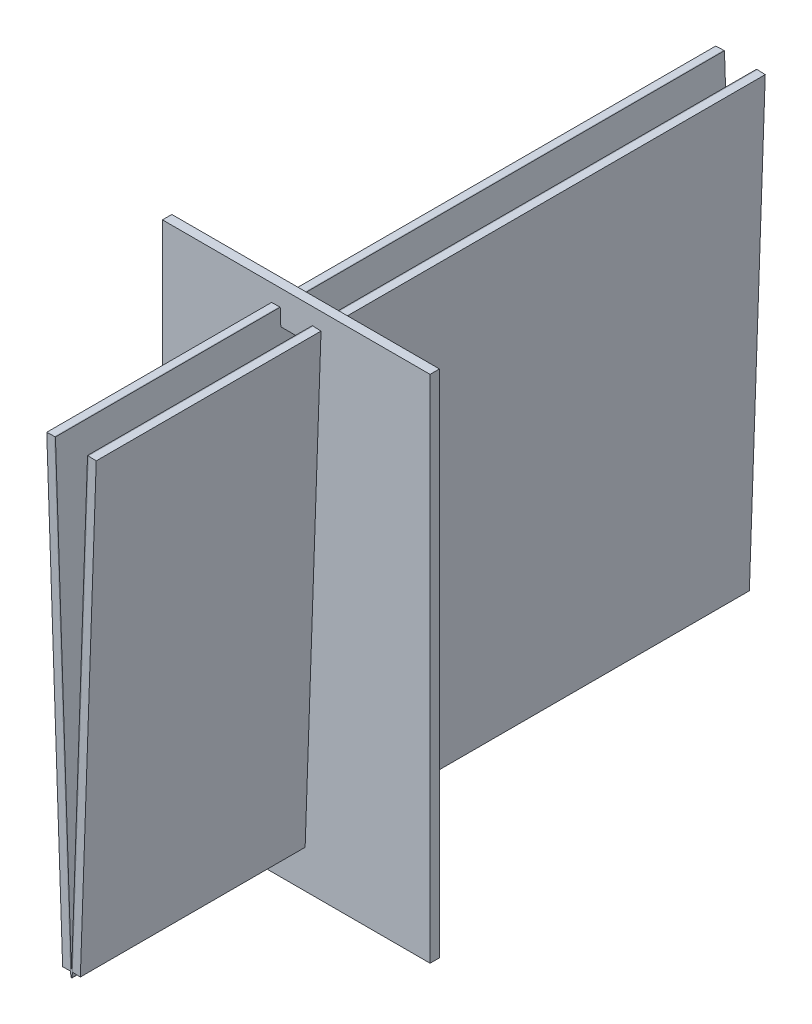
ISO-10303-21;
HEADER;
FILE_DESCRIPTION(('STEP AP214'),'2;1');
FILE_NAME('part.step','',(''),(''),'','','');
FILE_SCHEMA(('AUTOMOTIVE_DESIGN { 1 0 10303 214 1 1 1 1 }'));
ENDSEC;
DATA;
#1=APPLICATION_CONTEXT('core data for automotive mechanical design processes');
#2=APPLICATION_PROTOCOL_DEFINITION('international standard','automotive_design',2000,#1);
#3=PRODUCT_CONTEXT('',#1,'mechanical');
#4=PRODUCT('Part','Part','',(#3));
#5=PRODUCT_RELATED_PRODUCT_CATEGORY('part','',(#4));
#6=PRODUCT_DEFINITION_FORMATION('','',#4);
#7=PRODUCT_DEFINITION_CONTEXT('part definition',#1,'design');
#8=PRODUCT_DEFINITION('design','',#6,#7);
#9=PRODUCT_DEFINITION_SHAPE('','',#8);
#10=(LENGTH_UNIT() NAMED_UNIT(*) SI_UNIT(.MILLI.,.METRE.));
#11=(NAMED_UNIT(*) PLANE_ANGLE_UNIT() SI_UNIT($,.RADIAN.));
#12=(NAMED_UNIT(*) SI_UNIT($,.STERADIAN.) SOLID_ANGLE_UNIT());
#13=UNCERTAINTY_MEASURE_WITH_UNIT(LENGTH_MEASURE(1.E-05),#10,'distance_accuracy_value','');
#14=(GEOMETRIC_REPRESENTATION_CONTEXT(3) GLOBAL_UNCERTAINTY_ASSIGNED_CONTEXT((#13)) GLOBAL_UNIT_ASSIGNED_CONTEXT((#10,
#11,#12)) REPRESENTATION_CONTEXT('',''));
#15=CARTESIAN_POINT('',(0.,0.,0.));
#16=DIRECTION('',(0.,0.,1.));
#17=DIRECTION('',(1.,0.,0.));
#18=AXIS2_PLACEMENT_3D('',#15,#16,#17);
#19=CARTESIAN_POINT('',(0.,0.,32.8));
#20=DIRECTION('',(0.,0.,-1.));
#21=DIRECTION('',(-1.,0.,0.));
#22=AXIS2_PLACEMENT_3D('',#19,#20,#21);
#23=PLANE('',#22);
#24=DIRECTION('',(0.,1.,0.));
#25=VECTOR('',#24,1.);
#26=CARTESIAN_POINT('',(40.,141.029182993189,32.8));
#27=LINE('',#26,#25);
#28=CARTESIAN_POINT('',(40.,-11.4351401860784,32.8));
#29=VERTEX_POINT('',#28);
#30=CARTESIAN_POINT('',(40.,141.029182993189,32.8));
#31=VERTEX_POINT('',#30);
#32=EDGE_CURVE('E203',#29,#31,#27,.T.);
#33=ORIENTED_EDGE('',*,*,#32,.T.);
#34=DIRECTION('',(-1.,0.,0.));
#35=VECTOR('',#34,1.);
#36=CARTESIAN_POINT('',(-40.,141.029182993189,32.8));
#37=LINE('',#36,#35);
#38=CARTESIAN_POINT('',(-40.,141.029182993189,32.8));
#39=VERTEX_POINT('',#38);
#40=EDGE_CURVE('E206',#31,#39,#37,.T.);
#41=ORIENTED_EDGE('',*,*,#40,.T.);
#42=DIRECTION('',(0.,-1.,0.));
#43=VECTOR('',#42,1.);
#44=CARTESIAN_POINT('',(-40.,-11.4351401860784,32.8));
#45=LINE('',#44,#43);
#46=CARTESIAN_POINT('',(-40.,-11.4351401860784,32.8));
#47=VERTEX_POINT('',#46);
#48=EDGE_CURVE('E209',#39,#47,#45,.T.);
#49=ORIENTED_EDGE('',*,*,#48,.T.);
#50=DIRECTION('',(1.,0.,0.));
#51=VECTOR('',#50,1.);
#52=CARTESIAN_POINT('',(40.,-11.4351401860784,32.8));
#53=LINE('',#52,#51);
#54=EDGE_CURVE('E211',#47,#29,#53,.T.);
#55=ORIENTED_EDGE('',*,*,#54,.T.);
#56=EDGE_LOOP('',(#33,#41,#49,#55));
#57=FACE_BOUND('',#56,.T.);
#58=DIRECTION('',(-0.999390827019096,-0.0348994967025024,0.));
#59=VECTOR('',#58,1.);
#60=CARTESIAN_POINT('',(-4.80012183459618,136.029182993189,32.8));
#61=LINE('',#60,#59);
#62=CARTESIAN_POINT('',(-4.80012183459618,136.029182993189,32.8));
#63=VERTEX_POINT('',#62);
#64=CARTESIAN_POINT('',(-7.39853798484583,135.938444301763,32.8));
#65=VERTEX_POINT('',#64);
#66=EDGE_CURVE('E138',#63,#65,#61,.T.);
#67=ORIENTED_EDGE('',*,*,#66,.F.);
#68=DIRECTION('',(-0.0348994967025014,0.999390827019096,0.));
#69=VECTOR('',#68,1.);
#70=CARTESIAN_POINT('',(-4.80012183459618,136.029182993189,32.8));
#71=LINE('',#70,#69);
#72=CARTESIAN_POINT('',(-4.62551798713744,131.029182993189,32.8));
#73=VERTEX_POINT('',#72);
#74=EDGE_CURVE('E171',#73,#63,#71,.T.);
#75=ORIENTED_EDGE('',*,*,#74,.F.);
#76=DIRECTION('',(-1.,0.,0.));
#77=VECTOR('',#76,1.);
#78=CARTESIAN_POINT('',(-4.62551798713744,131.029182993189,32.8));
#79=LINE('',#78,#77);
#80=CARTESIAN_POINT('',(4.62551798713744,131.029182993189,32.8));
#81=VERTEX_POINT('',#80);
#82=EDGE_CURVE('E169',#81,#73,#79,.T.);
#83=ORIENTED_EDGE('',*,*,#82,.F.);
#84=DIRECTION('',(-0.0348994967025012,-0.999390827019096,0.));
#85=VECTOR('',#84,1.);
#86=CARTESIAN_POINT('',(4.62551798713744,131.029182993189,32.8));
#87=LINE('',#86,#85);
#88=CARTESIAN_POINT('',(4.80012183459618,136.029182993189,32.8));
#89=VERTEX_POINT('',#88);
#90=EDGE_CURVE('E167',#89,#81,#87,.T.);
#91=ORIENTED_EDGE('',*,*,#90,.F.);
#92=DIRECTION('',(-0.999390827019096,0.0348994967025024,0.));
#93=VECTOR('',#92,1.);
#94=CARTESIAN_POINT('',(4.80012183459618,136.029182993189,32.8));
#95=LINE('',#94,#93);
#96=CARTESIAN_POINT('',(7.39853798484583,135.938444301763,32.8));
#97=VERTEX_POINT('',#96);
#98=EDGE_CURVE('E165',#97,#89,#95,.T.);
#99=ORIENTED_EDGE('',*,*,#98,.F.);
#100=DIRECTION('',(0.034899496702501,0.999390827019096,0.));
#101=VECTOR('',#100,1.);
#102=CARTESIAN_POINT('',(2.90079230508252,7.13985981392158,32.8));
#103=LINE('',#102,#101);
#104=CARTESIAN_POINT('',(2.90079230508252,7.13985981392158,32.8));
#105=VERTEX_POINT('',#104);
#106=EDGE_CURVE('E161',#105,#97,#103,.T.);
#107=ORIENTED_EDGE('',*,*,#106,.F.);
#108=DIRECTION('',(1.,0.,0.));
#109=VECTOR('',#108,1.);
#110=CARTESIAN_POINT('',(-2.90079230508252,7.13985981392158,32.8));
#111=LINE('',#110,#109);
#112=CARTESIAN_POINT('',(-2.90079230508252,7.13985981392158,32.8));
#113=VERTEX_POINT('',#112);
#114=EDGE_CURVE('E159',#113,#105,#111,.T.);
#115=ORIENTED_EDGE('',*,*,#114,.F.);
#116=DIRECTION('',(0.0348994967025011,-0.999390827019096,0.));
#117=VECTOR('',#116,1.);
#118=CARTESIAN_POINT('',(-7.39853798484583,135.938444301763,32.8));
#119=LINE('',#118,#117);
#120=EDGE_CURVE('E146',#65,#113,#119,.T.);
#121=ORIENTED_EDGE('',*,*,#120,.F.);
#122=EDGE_LOOP('',(#67,#75,#83,#91,#99,#107,#115,#121));
#123=FACE_BOUND('',#122,.T.);
#124=ADVANCED_FACE('F49',(#57,#123),#23,.F.);
#125=CARTESIAN_POINT('',(0.,0.,30.));
#126=DIRECTION('',(0.,0.,-1.));
#127=DIRECTION('',(-1.,0.,0.));
#128=AXIS2_PLACEMENT_3D('',#125,#126,#127);
#129=PLANE('',#128);
#130=DIRECTION('',(0.,1.,0.));
#131=VECTOR('',#130,1.);
#132=CARTESIAN_POINT('',(40.,141.029182993189,30.));
#133=LINE('',#132,#131);
#134=CARTESIAN_POINT('',(40.,-11.4351401860784,30.));
#135=VERTEX_POINT('',#134);
#136=CARTESIAN_POINT('',(40.,141.029182993189,30.));
#137=VERTEX_POINT('',#136);
#138=EDGE_CURVE('E154',#135,#137,#133,.T.);
#139=ORIENTED_EDGE('',*,*,#138,.F.);
#140=DIRECTION('',(1.,0.,0.));
#141=VECTOR('',#140,1.);
#142=CARTESIAN_POINT('',(40.,-11.4351401860784,30.));
#143=LINE('',#142,#141);
#144=CARTESIAN_POINT('',(-40.,-11.4351401860784,30.));
#145=VERTEX_POINT('',#144);
#146=EDGE_CURVE('E207',#145,#135,#143,.T.);
#147=ORIENTED_EDGE('',*,*,#146,.F.);
#148=DIRECTION('',(0.,-1.,0.));
#149=VECTOR('',#148,1.);
#150=CARTESIAN_POINT('',(-40.,-11.4351401860784,30.));
#151=LINE('',#150,#149);
#152=CARTESIAN_POINT('',(-40.,141.029182993189,30.));
#153=VERTEX_POINT('',#152);
#154=EDGE_CURVE('E218',#153,#145,#151,.T.);
#155=ORIENTED_EDGE('',*,*,#154,.F.);
#156=DIRECTION('',(-1.,0.,0.));
#157=VECTOR('',#156,1.);
#158=CARTESIAN_POINT('',(-40.,141.029182993189,30.));
#159=LINE('',#158,#157);
#160=EDGE_CURVE('E216',#137,#153,#159,.T.);
#161=ORIENTED_EDGE('',*,*,#160,.F.);
#162=EDGE_LOOP('',(#139,#147,#155,#161));
#163=FACE_BOUND('',#162,.T.);
#164=DIRECTION('',(-0.0348994967025014,0.999390827019096,0.));
#165=VECTOR('',#164,1.);
#166=CARTESIAN_POINT('',(-4.80012183459618,136.029182993189,30.));
#167=LINE('',#166,#165);
#168=CARTESIAN_POINT('',(-4.62551798713744,131.029182993189,30.));
#169=VERTEX_POINT('',#168);
#170=CARTESIAN_POINT('',(-4.80012183459618,136.029182993189,30.));
#171=VERTEX_POINT('',#170);
#172=EDGE_CURVE('E147',#169,#171,#167,.T.);
#173=ORIENTED_EDGE('',*,*,#172,.T.);
#174=DIRECTION('',(-0.999390827019096,-0.0348994967025024,0.));
#175=VECTOR('',#174,1.);
#176=CARTESIAN_POINT('',(-4.80012183459618,136.029182993189,30.));
#177=LINE('',#176,#175);
#178=CARTESIAN_POINT('',(-7.39853798484583,135.938444301763,30.));
#179=VERTEX_POINT('',#178);
#180=EDGE_CURVE('E72',#171,#179,#177,.T.);
#181=ORIENTED_EDGE('',*,*,#180,.T.);
#182=DIRECTION('',(0.0348994967025011,-0.999390827019096,0.));
#183=VECTOR('',#182,1.);
#184=CARTESIAN_POINT('',(-7.39853798484583,135.938444301763,30.));
#185=LINE('',#184,#183);
#186=CARTESIAN_POINT('',(-2.90079230508252,7.13985981392158,30.));
#187=VERTEX_POINT('',#186);
#188=EDGE_CURVE('E153',#179,#187,#185,.T.);
#189=ORIENTED_EDGE('',*,*,#188,.T.);
#190=DIRECTION('',(1.,0.,0.));
#191=VECTOR('',#190,1.);
#192=CARTESIAN_POINT('',(-2.90079230508252,7.13985981392158,30.));
#193=LINE('',#192,#191);
#194=CARTESIAN_POINT('',(2.90079230508252,7.13985981392158,30.));
#195=VERTEX_POINT('',#194);
#196=EDGE_CURVE('E175',#187,#195,#193,.T.);
#197=ORIENTED_EDGE('',*,*,#196,.T.);
#198=DIRECTION('',(0.034899496702501,0.999390827019096,0.));
#199=VECTOR('',#198,1.);
#200=CARTESIAN_POINT('',(2.90079230508252,7.13985981392158,30.));
#201=LINE('',#200,#199);
#202=CARTESIAN_POINT('',(7.39853798484583,135.938444301763,30.));
#203=VERTEX_POINT('',#202);
#204=EDGE_CURVE('E178',#195,#203,#201,.T.);
#205=ORIENTED_EDGE('',*,*,#204,.T.);
#206=DIRECTION('',(-0.999390827019096,0.0348994967025024,0.));
#207=VECTOR('',#206,1.);
#208=CARTESIAN_POINT('',(4.80012183459618,136.029182993189,30.));
#209=LINE('',#208,#207);
#210=CARTESIAN_POINT('',(4.80012183459618,136.029182993189,30.));
#211=VERTEX_POINT('',#210);
#212=EDGE_CURVE('E181',#203,#211,#209,.T.);
#213=ORIENTED_EDGE('',*,*,#212,.T.);
#214=DIRECTION('',(-0.0348994967025012,-0.999390827019096,0.));
#215=VECTOR('',#214,1.);
#216=CARTESIAN_POINT('',(4.62551798713744,131.029182993189,30.));
#217=LINE('',#216,#215);
#218=CARTESIAN_POINT('',(4.62551798713744,131.029182993189,30.));
#219=VERTEX_POINT('',#218);
#220=EDGE_CURVE('E184',#211,#219,#217,.T.);
#221=ORIENTED_EDGE('',*,*,#220,.T.);
#222=DIRECTION('',(-1.,0.,0.));
#223=VECTOR('',#222,1.);
#224=CARTESIAN_POINT('',(-4.62551798713744,131.029182993189,30.));
#225=LINE('',#224,#223);
#226=EDGE_CURVE('E187',#219,#169,#225,.T.);
#227=ORIENTED_EDGE('',*,*,#226,.T.);
#228=EDGE_LOOP('',(#173,#181,#189,#197,#205,#213,#221,#227));
#229=FACE_BOUND('',#228,.T.);
#230=ADVANCED_FACE('F236',(#163,#229),#129,.T.);
#231=CARTESIAN_POINT('',(40.,141.029182993189,32.8));
#232=DIRECTION('',(-1.,0.,0.));
#233=DIRECTION('',(0.,-1.,0.));
#234=AXIS2_PLACEMENT_3D('',#231,#232,#233);
#235=PLANE('',#234);
#236=ORIENTED_EDGE('',*,*,#138,.T.);
#237=DIRECTION('',(0.,0.,-1.));
#238=VECTOR('',#237,1.);
#239=CARTESIAN_POINT('',(40.,141.029182993189,32.8));
#240=LINE('',#239,#238);
#241=EDGE_CURVE('E12',#31,#137,#240,.T.);
#242=ORIENTED_EDGE('',*,*,#241,.F.);
#243=ORIENTED_EDGE('',*,*,#32,.F.);
#244=DIRECTION('',(0.,0.,-1.));
#245=VECTOR('',#244,1.);
#246=CARTESIAN_POINT('',(40.,-11.4351401860784,32.8));
#247=LINE('',#246,#245);
#248=EDGE_CURVE('E213',#29,#135,#247,.T.);
#249=ORIENTED_EDGE('',*,*,#248,.T.);
#250=EDGE_LOOP('',(#236,#242,#243,#249));
#251=FACE_BOUND('',#250,.T.);
#252=ADVANCED_FACE('F51',(#251),#235,.F.);
#253=CARTESIAN_POINT('',(-40.,141.029182993189,32.8));
#254=DIRECTION('',(0.,-1.,0.));
#255=DIRECTION('',(0.,0.,-1.));
#256=AXIS2_PLACEMENT_3D('',#253,#254,#255);
#257=PLANE('',#256);
#258=ORIENTED_EDGE('',*,*,#160,.T.);
#259=DIRECTION('',(0.,0.,-1.));
#260=VECTOR('',#259,1.);
#261=CARTESIAN_POINT('',(-40.,141.029182993189,32.8));
#262=LINE('',#261,#260);
#263=EDGE_CURVE('E57',#39,#153,#262,.T.);
#264=ORIENTED_EDGE('',*,*,#263,.F.);
#265=ORIENTED_EDGE('',*,*,#40,.F.);
#266=ORIENTED_EDGE('',*,*,#241,.T.);
#267=EDGE_LOOP('',(#258,#264,#265,#266));
#268=FACE_BOUND('',#267,.T.);
#269=ADVANCED_FACE('F246',(#268),#257,.F.);
#270=CARTESIAN_POINT('',(-40.,-11.4351401860784,32.8));
#271=DIRECTION('',(1.,0.,0.));
#272=DIRECTION('',(0.,1.,0.));
#273=AXIS2_PLACEMENT_3D('',#270,#271,#272);
#274=PLANE('',#273);
#275=ORIENTED_EDGE('',*,*,#154,.T.);
#276=DIRECTION('',(0.,0.,-1.));
#277=VECTOR('',#276,1.);
#278=CARTESIAN_POINT('',(-40.,-11.4351401860784,32.8));
#279=LINE('',#278,#277);
#280=EDGE_CURVE('E223',#47,#145,#279,.T.);
#281=ORIENTED_EDGE('',*,*,#280,.F.);
#282=ORIENTED_EDGE('',*,*,#48,.F.);
#283=ORIENTED_EDGE('',*,*,#263,.T.);
#284=EDGE_LOOP('',(#275,#281,#282,#283));
#285=FACE_BOUND('',#284,.T.);
#286=ADVANCED_FACE('F230',(#285),#274,.F.);
#287=CARTESIAN_POINT('',(40.,-11.4351401860784,32.8));
#288=DIRECTION('',(0.,1.,0.));
#289=DIRECTION('',(0.,0.,1.));
#290=AXIS2_PLACEMENT_3D('',#287,#288,#289);
#291=PLANE('',#290);
#292=ORIENTED_EDGE('',*,*,#146,.T.);
#293=ORIENTED_EDGE('',*,*,#248,.F.);
#294=ORIENTED_EDGE('',*,*,#54,.F.);
#295=ORIENTED_EDGE('',*,*,#280,.T.);
#296=EDGE_LOOP('',(#292,#293,#294,#295));
#297=FACE_BOUND('',#296,.T.);
#298=ADVANCED_FACE('F240',(#297),#291,.F.);
#299=CARTESIAN_POINT('',(-4.80012183459618,136.029182993189,32.8));
#300=DIRECTION('',(0.0348994967025024,-0.999390827019096,0.));
#301=DIRECTION('',(0.999390827019096,0.0348994967025024,0.));
#302=AXIS2_PLACEMENT_3D('',#299,#300,#301);
#303=PLANE('',#302);
#304=ORIENTED_EDGE('',*,*,#180,.F.);
#305=DIRECTION('',(0.,0.,-1.));
#306=VECTOR('',#305,1.);
#307=CARTESIAN_POINT('',(-4.80012183459618,136.029182993189,32.8));
#308=LINE('',#307,#306);
#309=EDGE_CURVE('E142',#63,#171,#308,.T.);
#310=ORIENTED_EDGE('',*,*,#309,.F.);
#311=ORIENTED_EDGE('',*,*,#66,.T.);
#312=DIRECTION('',(0.,0.,-1.));
#313=VECTOR('',#312,1.);
#314=CARTESIAN_POINT('',(-7.39853798484583,135.938444301763,32.8));
#315=LINE('',#314,#313);
#316=EDGE_CURVE('E141',#65,#179,#315,.T.);
#317=ORIENTED_EDGE('',*,*,#316,.T.);
#318=EDGE_LOOP('',(#304,#310,#311,#317));
#319=FACE_BOUND('',#318,.T.);
#320=ADVANCED_FACE('F140',(#319),#303,.T.);
#321=CARTESIAN_POINT('',(-7.39853798484583,135.938444301763,32.8));
#322=DIRECTION('',(0.999390827019096,0.0348994967025011,0.));
#323=DIRECTION('',(-0.0348994967025011,0.999390827019096,0.));
#324=AXIS2_PLACEMENT_3D('',#321,#322,#323);
#325=PLANE('',#324);
#326=ORIENTED_EDGE('',*,*,#188,.F.);
#327=ORIENTED_EDGE('',*,*,#316,.F.);
#328=ORIENTED_EDGE('',*,*,#120,.T.);
#329=DIRECTION('',(0.,0.,-1.));
#330=VECTOR('',#329,1.);
#331=CARTESIAN_POINT('',(-2.90079230508252,7.13985981392158,32.8));
#332=LINE('',#331,#330);
#333=EDGE_CURVE('E155',#113,#187,#332,.T.);
#334=ORIENTED_EDGE('',*,*,#333,.T.);
#335=EDGE_LOOP('',(#326,#327,#328,#334));
#336=FACE_BOUND('',#335,.T.);
#337=ADVANCED_FACE('F150',(#336),#325,.T.);
#338=CARTESIAN_POINT('',(-2.90079230508252,7.13985981392158,32.8));
#339=DIRECTION('',(0.,1.,0.));
#340=DIRECTION('',(0.,0.,1.));
#341=AXIS2_PLACEMENT_3D('',#338,#339,#340);
#342=PLANE('',#341);
#343=ORIENTED_EDGE('',*,*,#196,.F.);
#344=ORIENTED_EDGE('',*,*,#333,.F.);
#345=ORIENTED_EDGE('',*,*,#114,.T.);
#346=DIRECTION('',(0.,0.,-1.));
#347=VECTOR('',#346,1.);
#348=CARTESIAN_POINT('',(2.90079230508252,7.13985981392158,32.8));
#349=LINE('',#348,#347);
#350=EDGE_CURVE('E200',#105,#195,#349,.T.);
#351=ORIENTED_EDGE('',*,*,#350,.T.);
#352=EDGE_LOOP('',(#343,#344,#345,#351));
#353=FACE_BOUND('',#352,.T.);
#354=ADVANCED_FACE('F269',(#353),#342,.T.);
#355=CARTESIAN_POINT('',(2.90079230508252,7.13985981392158,32.8));
#356=DIRECTION('',(-0.999390827019096,0.034899496702501,0.));
#357=DIRECTION('',(-0.034899496702501,-0.999390827019096,0.));
#358=AXIS2_PLACEMENT_3D('',#355,#356,#357);
#359=PLANE('',#358);
#360=ORIENTED_EDGE('',*,*,#204,.F.);
#361=ORIENTED_EDGE('',*,*,#350,.F.);
#362=ORIENTED_EDGE('',*,*,#106,.T.);
#363=DIRECTION('',(0.,0.,-1.));
#364=VECTOR('',#363,1.);
#365=CARTESIAN_POINT('',(7.39853798484583,135.938444301763,32.8));
#366=LINE('',#365,#364);
#367=EDGE_CURVE('E198',#97,#203,#366,.T.);
#368=ORIENTED_EDGE('',*,*,#367,.T.);
#369=EDGE_LOOP('',(#360,#361,#362,#368));
#370=FACE_BOUND('',#369,.T.);
#371=ADVANCED_FACE('F273',(#370),#359,.T.);
#372=CARTESIAN_POINT('',(4.80012183459618,136.029182993189,32.8));
#373=DIRECTION('',(-0.0348994967025024,-0.999390827019096,0.));
#374=DIRECTION('',(0.999390827019096,-0.0348994967025024,0.));
#375=AXIS2_PLACEMENT_3D('',#372,#373,#374);
#376=PLANE('',#375);
#377=ORIENTED_EDGE('',*,*,#212,.F.);
#378=ORIENTED_EDGE('',*,*,#367,.F.);
#379=ORIENTED_EDGE('',*,*,#98,.T.);
#380=DIRECTION('',(0.,0.,-1.));
#381=VECTOR('',#380,1.);
#382=CARTESIAN_POINT('',(4.80012183459618,136.029182993189,32.8));
#383=LINE('',#382,#381);
#384=EDGE_CURVE('E196',#89,#211,#383,.T.);
#385=ORIENTED_EDGE('',*,*,#384,.T.);
#386=EDGE_LOOP('',(#377,#378,#379,#385));
#387=FACE_BOUND('',#386,.T.);
#388=ADVANCED_FACE('F279',(#387),#376,.T.);
#389=CARTESIAN_POINT('',(4.62551798713744,131.029182993189,32.8));
#390=DIRECTION('',(0.999390827019096,-0.0348994967025012,0.));
#391=DIRECTION('',(0.0348994967025012,0.999390827019096,0.));
#392=AXIS2_PLACEMENT_3D('',#389,#390,#391);
#393=PLANE('',#392);
#394=ORIENTED_EDGE('',*,*,#220,.F.);
#395=ORIENTED_EDGE('',*,*,#384,.F.);
#396=ORIENTED_EDGE('',*,*,#90,.T.);
#397=DIRECTION('',(0.,0.,-1.));
#398=VECTOR('',#397,1.);
#399=CARTESIAN_POINT('',(4.62551798713744,131.029182993189,32.8));
#400=LINE('',#399,#398);
#401=EDGE_CURVE('E194',#81,#219,#400,.T.);
#402=ORIENTED_EDGE('',*,*,#401,.T.);
#403=EDGE_LOOP('',(#394,#395,#396,#402));
#404=FACE_BOUND('',#403,.T.);
#405=ADVANCED_FACE('F283',(#404),#393,.T.);
#406=CARTESIAN_POINT('',(-4.62551798713744,131.029182993189,32.8));
#407=DIRECTION('',(0.,-1.,0.));
#408=DIRECTION('',(0.,0.,-1.));
#409=AXIS2_PLACEMENT_3D('',#406,#407,#408);
#410=PLANE('',#409);
#411=ORIENTED_EDGE('',*,*,#226,.F.);
#412=ORIENTED_EDGE('',*,*,#401,.F.);
#413=ORIENTED_EDGE('',*,*,#82,.T.);
#414=DIRECTION('',(0.,0.,-1.));
#415=VECTOR('',#414,1.);
#416=CARTESIAN_POINT('',(-4.62551798713744,131.029182993189,32.8));
#417=LINE('',#416,#415);
#418=EDGE_CURVE('E64',#73,#169,#417,.T.);
#419=ORIENTED_EDGE('',*,*,#418,.T.);
#420=EDGE_LOOP('',(#411,#412,#413,#419));
#421=FACE_BOUND('',#420,.T.);
#422=ADVANCED_FACE('F287',(#421),#410,.T.);
#423=CARTESIAN_POINT('',(-4.80012183459618,136.029182993189,32.8));
#424=DIRECTION('',(-0.999390827019096,-0.0348994967025014,0.));
#425=DIRECTION('',(0.0348994967025014,-0.999390827019096,0.));
#426=AXIS2_PLACEMENT_3D('',#423,#424,#425);
#427=PLANE('',#426);
#428=ORIENTED_EDGE('',*,*,#172,.F.);
#429=ORIENTED_EDGE('',*,*,#418,.F.);
#430=ORIENTED_EDGE('',*,*,#74,.T.);
#431=ORIENTED_EDGE('',*,*,#309,.T.);
#432=EDGE_LOOP('',(#428,#429,#430,#431));
#433=FACE_BOUND('',#432,.T.);
#434=ADVANCED_FACE('F291',(#433),#427,.T.);
#435=CLOSED_SHELL('',(#124,#230,#252,#269,#286,#298,#320,#337,#354,#371,#388,#405,#422,#434));
#436=MANIFOLD_SOLID_BREP('B2',#435);
#437=CARTESIAN_POINT('',(-4.80012183459618,136.029182993189,238.020247010752));
#438=DIRECTION('',(-0.999390827019096,-0.0348994967025015,0.));
#439=DIRECTION('',(0.0348994967025015,-0.999390827019096,0.));
#440=AXIS2_PLACEMENT_3D('',#437,#438,#439);
#441=PLANE('',#440);
#442=DIRECTION('',(0.,0.,-1.));
#443=VECTOR('',#442,1.);
#444=CARTESIAN_POINT('',(-4.80012183459618,136.029182993189,238.020247010752));
#445=LINE('',#444,#443);
#446=CARTESIAN_POINT('',(-4.80012183459618,136.029182993189,100.));
#447=VERTEX_POINT('',#446);
#448=CARTESIAN_POINT('',(-4.80012183459618,136.029182993189,-100.));
#449=VERTEX_POINT('',#448);
#450=EDGE_CURVE('E490',#447,#449,#445,.T.);
#451=ORIENTED_EDGE('',*,*,#450,.F.);
#452=DIRECTION('',(0.0348994967025015,-0.999390827019096,0.));
#453=VECTOR('',#452,1.);
#454=CARTESIAN_POINT('',(-4.80012183459618,136.029182993189,100.));
#455=LINE('',#454,#453);
#456=CARTESIAN_POINT('',(0.,-1.42832165115928,100.));
#457=VERTEX_POINT('',#456);
#458=EDGE_CURVE('E410',#447,#457,#455,.T.);
#459=ORIENTED_EDGE('',*,*,#458,.T.);
#460=DIRECTION('',(0.,0.,-1.));
#461=VECTOR('',#460,1.);
#462=CARTESIAN_POINT('',(0.,-1.42832165115928,238.020247010752));
#463=LINE('',#462,#461);
#464=CARTESIAN_POINT('',(0.,-1.4283216511593,-100.));
#465=VERTEX_POINT('',#464);
#466=EDGE_CURVE('E513',#457,#465,#463,.T.);
#467=ORIENTED_EDGE('',*,*,#466,.T.);
#468=DIRECTION('',(-0.0348994967025015,0.999390827019096,0.));
#469=VECTOR('',#468,1.);
#470=CARTESIAN_POINT('',(-4.80012183459618,136.029182993189,-100.));
#471=LINE('',#470,#469);
#472=EDGE_CURVE('E491',#465,#449,#471,.T.);
#473=ORIENTED_EDGE('',*,*,#472,.T.);
#474=EDGE_LOOP('',(#451,#459,#467,#473));
#475=FACE_BOUND('',#474,.T.);
#476=ADVANCED_FACE('F406',(#475),#441,.F.);
#477=CARTESIAN_POINT('',(4.80012183459618,136.029182993189,238.020247010752));
#478=DIRECTION('',(0.999390827019096,-0.0348994967025011,0.));
#479=DIRECTION('',(0.0348994967025011,0.999390827019096,0.));
#480=AXIS2_PLACEMENT_3D('',#477,#478,#479);
#481=PLANE('',#480);
#482=ORIENTED_EDGE('',*,*,#466,.F.);
#483=DIRECTION('',(0.0348994967025011,0.999390827019096,0.));
#484=VECTOR('',#483,1.);
#485=CARTESIAN_POINT('',(4.80012183459618,136.029182993189,100.));
#486=LINE('',#485,#484);
#487=CARTESIAN_POINT('',(4.80012183459618,136.029182993189,100.));
#488=VERTEX_POINT('',#487);
#489=EDGE_CURVE('E501',#457,#488,#486,.T.);
#490=ORIENTED_EDGE('',*,*,#489,.T.);
#491=DIRECTION('',(0.,0.,-1.));
#492=VECTOR('',#491,1.);
#493=CARTESIAN_POINT('',(4.80012183459618,136.029182993189,238.020247010752));
#494=LINE('',#493,#492);
#495=CARTESIAN_POINT('',(4.80012183459618,136.029182993189,-100.));
#496=VERTEX_POINT('',#495);
#497=EDGE_CURVE('E515',#488,#496,#494,.T.);
#498=ORIENTED_EDGE('',*,*,#497,.T.);
#499=DIRECTION('',(-0.0348994967025011,-0.999390827019096,0.));
#500=VECTOR('',#499,1.);
#501=CARTESIAN_POINT('',(4.80012183459618,136.029182993189,-100.));
#502=LINE('',#501,#500);
#503=EDGE_CURVE('E494',#496,#465,#502,.T.);
#504=ORIENTED_EDGE('',*,*,#503,.T.);
#505=EDGE_LOOP('',(#482,#490,#498,#504));
#506=FACE_BOUND('',#505,.T.);
#507=ADVANCED_FACE('F528',(#506),#481,.F.);
#508=CARTESIAN_POINT('',(4.80012183459618,136.029182993189,238.020247010752));
#509=DIRECTION('',(-0.0348994967025453,-0.999390827019094,0.));
#510=DIRECTION('',(0.999390827019094,-0.0348994967025453,0.));
#511=AXIS2_PLACEMENT_3D('',#508,#509,#510);
#512=PLANE('',#511);
#513=ORIENTED_EDGE('',*,*,#497,.F.);
#514=DIRECTION('',(0.999390827019094,-0.0348994967025453,0.));
#515=VECTOR('',#514,1.);
#516=CARTESIAN_POINT('',(4.80012183459618,136.029182993189,100.));
#517=LINE('',#516,#515);
#518=CARTESIAN_POINT('',(5.,136.022203093849,100.));
#519=VERTEX_POINT('',#518);
#520=EDGE_CURVE('E504',#488,#519,#517,.T.);
#521=ORIENTED_EDGE('',*,*,#520,.T.);
#522=DIRECTION('',(0.,0.,-1.));
#523=VECTOR('',#522,1.);
#524=CARTESIAN_POINT('',(5.,136.022203093849,238.020247010752));
#525=LINE('',#524,#523);
#526=CARTESIAN_POINT('',(5.,136.022203093849,-100.));
#527=VERTEX_POINT('',#526);
#528=EDGE_CURVE('E517',#519,#527,#525,.T.);
#529=ORIENTED_EDGE('',*,*,#528,.T.);
#530=DIRECTION('',(-0.999390827019094,0.0348994967025453,0.));
#531=VECTOR('',#530,1.);
#532=CARTESIAN_POINT('',(4.80012183459618,136.029182993189,-100.));
#533=LINE('',#532,#531);
#534=EDGE_CURVE('E497',#527,#496,#533,.T.);
#535=ORIENTED_EDGE('',*,*,#534,.T.);
#536=EDGE_LOOP('',(#513,#521,#529,#535));
#537=FACE_BOUND('',#536,.T.);
#538=ADVANCED_FACE('F531',(#537),#512,.F.);
#539=CARTESIAN_POINT('',(5.,136.022203093849,238.020247010752));
#540=DIRECTION('',(-0.999390827019096,0.034899496702501,0.));
#541=DIRECTION('',(-0.034899496702501,-0.999390827019096,0.));
#542=AXIS2_PLACEMENT_3D('',#539,#540,#541);
#543=PLANE('',#542);
#544=ORIENTED_EDGE('',*,*,#528,.F.);
#545=DIRECTION('',(-0.034899496702501,-0.999390827019096,0.));
#546=VECTOR('',#545,1.);
#547=CARTESIAN_POINT('',(5.,136.022203093849,100.));
#548=LINE('',#547,#546);
#549=CARTESIAN_POINT('',(0.199878165403848,-1.43530155049981,100.));
#550=VERTEX_POINT('',#549);
#551=EDGE_CURVE('E507',#519,#550,#548,.T.);
#552=ORIENTED_EDGE('',*,*,#551,.T.);
#553=DIRECTION('',(0.,0.,-1.));
#554=VECTOR('',#553,1.);
#555=CARTESIAN_POINT('',(0.199878165403849,-1.43530155049977,238.020247010752));
#556=LINE('',#555,#554);
#557=CARTESIAN_POINT('',(0.199878165403849,-1.43530155049977,-100.));
#558=VERTEX_POINT('',#557);
#559=EDGE_CURVE('E471',#550,#558,#556,.T.);
#560=ORIENTED_EDGE('',*,*,#559,.T.);
#561=DIRECTION('',(0.034899496702501,0.999390827019096,0.));
#562=VECTOR('',#561,1.);
#563=CARTESIAN_POINT('',(5.,136.022203093849,-100.));
#564=LINE('',#563,#562);
#565=EDGE_CURVE('E482',#558,#527,#564,.T.);
#566=ORIENTED_EDGE('',*,*,#565,.T.);
#567=EDGE_LOOP('',(#544,#552,#560,#566));
#568=FACE_BOUND('',#567,.T.);
#569=ADVANCED_FACE('F534',(#568),#543,.F.);
#570=CARTESIAN_POINT('',(0.,-1.42832165115986,238.020247010752));
#571=DIRECTION('',(0.,0.,-1.));
#572=DIRECTION('',(-1.,0.,0.));
#573=AXIS2_PLACEMENT_3D('',#570,#571,#572);
#574=CYLINDRICAL_SURFACE('',#573,0.2);
#575=ORIENTED_EDGE('',*,*,#559,.F.);
#576=CARTESIAN_POINT('',(0.,-1.42832165115986,100.));
#577=DIRECTION('',(0.,0.,-1.));
#578=DIRECTION('',(-1.,0.,0.));
#579=AXIS2_PLACEMENT_3D('',#576,#577,#578);
#580=CIRCLE('',#579,0.2);
#581=CARTESIAN_POINT('',(-0.199878165403831,-1.43530155049977,100.));
#582=VERTEX_POINT('',#581);
#583=EDGE_CURVE('E427',#550,#582,#580,.T.);
#584=ORIENTED_EDGE('',*,*,#583,.T.);
#585=DIRECTION('',(0.,0.,-1.));
#586=VECTOR('',#585,1.);
#587=CARTESIAN_POINT('',(-0.199878165403831,-1.43530155049977,238.020247010752));
#588=LINE('',#587,#586);
#589=CARTESIAN_POINT('',(-0.199878165403831,-1.43530155049977,-100.));
#590=VERTEX_POINT('',#589);
#591=EDGE_CURVE('E464',#582,#590,#588,.T.);
#592=ORIENTED_EDGE('',*,*,#591,.T.);
#593=CARTESIAN_POINT('',(0.,-1.42832165115986,-100.));
#594=DIRECTION('',(0.,0.,-1.));
#595=DIRECTION('',(-1.,0.,0.));
#596=AXIS2_PLACEMENT_3D('',#593,#594,#595);
#597=CIRCLE('',#596,0.2);
#598=EDGE_CURVE('E467',#590,#558,#597,.F.);
#599=ORIENTED_EDGE('',*,*,#598,.T.);
#600=EDGE_LOOP('',(#575,#584,#592,#599));
#601=FACE_BOUND('',#600,.T.);
#602=ADVANCED_FACE('F466',(#601),#574,.T.);
#603=CARTESIAN_POINT('',(-5.,136.022203093849,238.020247010752));
#604=DIRECTION('',(0.999390827019096,0.0348994967025012,0.));
#605=DIRECTION('',(-0.0348994967025012,0.999390827019096,0.));
#606=AXIS2_PLACEMENT_3D('',#603,#604,#605);
#607=PLANE('',#606);
#608=ORIENTED_EDGE('',*,*,#591,.F.);
#609=DIRECTION('',(-0.0348994967025012,0.999390827019096,0.));
#610=VECTOR('',#609,1.);
#611=CARTESIAN_POINT('',(-5.,136.022203093849,100.));
#612=LINE('',#611,#610);
#613=CARTESIAN_POINT('',(-5.,136.022203093849,100.));
#614=VERTEX_POINT('',#613);
#615=EDGE_CURVE('E415',#582,#614,#612,.T.);
#616=ORIENTED_EDGE('',*,*,#615,.T.);
#617=DIRECTION('',(0.,0.,-1.));
#618=VECTOR('',#617,1.);
#619=CARTESIAN_POINT('',(-5.,136.022203093849,238.020247010752));
#620=LINE('',#619,#618);
#621=CARTESIAN_POINT('',(-5.,136.022203093849,-100.));
#622=VERTEX_POINT('',#621);
#623=EDGE_CURVE('E470',#614,#622,#620,.T.);
#624=ORIENTED_EDGE('',*,*,#623,.T.);
#625=DIRECTION('',(0.0348994967025012,-0.999390827019096,0.));
#626=VECTOR('',#625,1.);
#627=CARTESIAN_POINT('',(-5.,136.022203093849,-100.));
#628=LINE('',#627,#626);
#629=EDGE_CURVE('E478',#622,#590,#628,.T.);
#630=ORIENTED_EDGE('',*,*,#629,.T.);
#631=EDGE_LOOP('',(#608,#616,#624,#630));
#632=FACE_BOUND('',#631,.T.);
#633=ADVANCED_FACE('F484',(#632),#607,.F.);
#634=CARTESIAN_POINT('',(-5.,136.022203093849,238.020247010752));
#635=DIRECTION('',(0.0348994967025447,-0.999390827019094,0.));
#636=DIRECTION('',(0.999390827019094,0.0348994967025447,0.));
#637=AXIS2_PLACEMENT_3D('',#634,#635,#636);
#638=PLANE('',#637);
#639=ORIENTED_EDGE('',*,*,#623,.F.);
#640=DIRECTION('',(0.999390827019094,0.0348994967025447,0.));
#641=VECTOR('',#640,1.);
#642=CARTESIAN_POINT('',(-5.,136.022203093849,100.));
#643=LINE('',#642,#641);
#644=EDGE_CURVE('E47',#614,#447,#643,.T.);
#645=ORIENTED_EDGE('',*,*,#644,.T.);
#646=ORIENTED_EDGE('',*,*,#450,.T.);
#647=DIRECTION('',(-0.999390827019094,-0.0348994967025447,0.));
#648=VECTOR('',#647,1.);
#649=CARTESIAN_POINT('',(-5.,136.022203093849,-100.));
#650=LINE('',#649,#648);
#651=EDGE_CURVE('E488',#449,#622,#650,.T.);
#652=ORIENTED_EDGE('',*,*,#651,.T.);
#653=EDGE_LOOP('',(#639,#645,#646,#652));
#654=FACE_BOUND('',#653,.T.);
#655=ADVANCED_FACE('F408',(#654),#638,.F.);
#656=CARTESIAN_POINT('',(0.,0.,100.));
#657=DIRECTION('',(0.,0.,-1.));
#658=DIRECTION('',(-1.,0.,0.));
#659=AXIS2_PLACEMENT_3D('',#656,#657,#658);
#660=PLANE('',#659);
#661=ORIENTED_EDGE('',*,*,#615,.F.);
#662=ORIENTED_EDGE('',*,*,#583,.F.);
#663=ORIENTED_EDGE('',*,*,#551,.F.);
#664=ORIENTED_EDGE('',*,*,#520,.F.);
#665=ORIENTED_EDGE('',*,*,#489,.F.);
#666=ORIENTED_EDGE('',*,*,#458,.F.);
#667=ORIENTED_EDGE('',*,*,#644,.F.);
#668=EDGE_LOOP('',(#661,#662,#663,#664,#665,#666,#667));
#669=FACE_BOUND('',#668,.T.);
#670=ADVANCED_FACE('F524',(#669),#660,.F.);
#671=CARTESIAN_POINT('',(0.,0.,-100.));
#672=DIRECTION('',(0.,0.,-1.));
#673=DIRECTION('',(-1.,0.,0.));
#674=AXIS2_PLACEMENT_3D('',#671,#672,#673);
#675=PLANE('',#674);
#676=ORIENTED_EDGE('',*,*,#651,.F.);
#677=ORIENTED_EDGE('',*,*,#472,.F.);
#678=ORIENTED_EDGE('',*,*,#503,.F.);
#679=ORIENTED_EDGE('',*,*,#534,.F.);
#680=ORIENTED_EDGE('',*,*,#565,.F.);
#681=ORIENTED_EDGE('',*,*,#598,.F.);
#682=ORIENTED_EDGE('',*,*,#629,.F.);
#683=EDGE_LOOP('',(#676,#677,#678,#679,#680,#681,#682));
#684=FACE_BOUND('',#683,.T.);
#685=ADVANCED_FACE('F477',(#684),#675,.T.);
#686=CLOSED_SHELL('',(#476,#507,#538,#569,#602,#633,#655,#670,#685));
#687=MANIFOLD_SOLID_BREP('B6',#686);
#688=CARTESIAN_POINT('',(0.25,0.,100.));
#689=DIRECTION('',(0.034899496702501,0.999390827019096,0.));
#690=DIRECTION('',(-0.999390827019096,0.034899496702501,0.));
#691=AXIS2_PLACEMENT_3D('',#688,#689,#690);
#692=PLANE('',#691);
#693=DIRECTION('',(0.999390827019096,-0.034899496702501,0.));
#694=VECTOR('',#693,1.);
#695=CARTESIAN_POINT('',(0.25,0.,-100.));
#696=LINE('',#695,#694);
#697=CARTESIAN_POINT('',(0.25,0.,-100.));
#698=VERTEX_POINT('',#697);
#699=CARTESIAN_POINT('',(2.64853798484583,-0.0837587920860024,-100.));
#700=VERTEX_POINT('',#699);
#701=EDGE_CURVE('E679',#698,#700,#696,.T.);
#702=ORIENTED_EDGE('',*,*,#701,.T.);
#703=DIRECTION('',(0.,0.,-1.));
#704=VECTOR('',#703,1.);
#705=CARTESIAN_POINT('',(2.64853798484583,-0.0837587920860024,100.));
#706=LINE('',#705,#704);
#707=CARTESIAN_POINT('',(2.64853798484583,-0.0837587920860024,100.));
#708=VERTEX_POINT('',#707);
#709=EDGE_CURVE('E404',#708,#700,#706,.T.);
#710=ORIENTED_EDGE('',*,*,#709,.F.);
#711=DIRECTION('',(0.999390827019096,-0.034899496702501,0.));
#712=VECTOR('',#711,1.);
#713=CARTESIAN_POINT('',(0.25,0.,100.));
#714=LINE('',#713,#712);
#715=CARTESIAN_POINT('',(0.25,0.,100.));
#716=VERTEX_POINT('',#715);
#717=EDGE_CURVE('E667',#716,#708,#714,.T.);
#718=ORIENTED_EDGE('',*,*,#717,.F.);
#719=DIRECTION('',(0.,0.,-1.));
#720=VECTOR('',#719,1.);
#721=CARTESIAN_POINT('',(0.25,0.,100.));
#722=LINE('',#721,#720);
#723=EDGE_CURVE('E675',#716,#698,#722,.T.);
#724=ORIENTED_EDGE('',*,*,#723,.T.);
#725=EDGE_LOOP('',(#702,#710,#718,#724));
#726=FACE_BOUND('',#725,.T.);
#727=ADVANCED_FACE('F616',(#726),#692,.F.);
#728=CARTESIAN_POINT('',(2.64853798484583,-0.0837587920860024,100.));
#729=DIRECTION('',(-0.999390827019096,0.034899496702501,0.));
#730=DIRECTION('',(-0.034899496702501,-0.999390827019096,0.));
#731=AXIS2_PLACEMENT_3D('',#728,#729,#730);
#732=PLANE('',#731);
#733=DIRECTION('',(0.034899496702501,0.999390827019096,0.));
#734=VECTOR('',#733,1.);
#735=CARTESIAN_POINT('',(2.64853798484583,-0.0837587920860024,-100.));
#736=LINE('',#735,#734);
#737=CARTESIAN_POINT('',(7.39853798484583,135.938444301763,-100.));
#738=VERTEX_POINT('',#737);
#739=EDGE_CURVE('E671',#700,#738,#736,.T.);
#740=ORIENTED_EDGE('',*,*,#739,.T.);
#741=DIRECTION('',(0.,0.,-1.));
#742=VECTOR('',#741,1.);
#743=CARTESIAN_POINT('',(7.39853798484583,135.938444301763,100.));
#744=LINE('',#743,#742);
#745=CARTESIAN_POINT('',(7.39853798484583,135.938444301763,100.));
#746=VERTEX_POINT('',#745);
#747=EDGE_CURVE('E624',#746,#738,#744,.T.);
#748=ORIENTED_EDGE('',*,*,#747,.F.);
#749=DIRECTION('',(0.034899496702501,0.999390827019096,0.));
#750=VECTOR('',#749,1.);
#751=CARTESIAN_POINT('',(2.64853798484583,-0.0837587920860024,100.));
#752=LINE('',#751,#750);
#753=EDGE_CURVE('E662',#708,#746,#752,.T.);
#754=ORIENTED_EDGE('',*,*,#753,.F.);
#755=ORIENTED_EDGE('',*,*,#709,.T.);
#756=EDGE_LOOP('',(#740,#748,#754,#755));
#757=FACE_BOUND('',#756,.T.);
#758=ADVANCED_FACE('F670',(#757),#732,.F.);
#759=CARTESIAN_POINT('',(5.,136.022203093849,100.));
#760=DIRECTION('',(-0.0348994967024989,-0.999390827019096,0.));
#761=DIRECTION('',(0.999390827019096,-0.0348994967024989,0.));
#762=AXIS2_PLACEMENT_3D('',#759,#760,#761);
#763=PLANE('',#762);
#764=DIRECTION('',(-0.999390827019096,0.0348994967024989,0.));
#765=VECTOR('',#764,1.);
#766=CARTESIAN_POINT('',(5.,136.022203093849,-100.));
#767=LINE('',#766,#765);
#768=CARTESIAN_POINT('',(5.,136.022203093849,-100.));
#769=VERTEX_POINT('',#768);
#770=EDGE_CURVE('E649',#738,#769,#767,.T.);
#771=ORIENTED_EDGE('',*,*,#770,.T.);
#772=DIRECTION('',(0.,0.,-1.));
#773=VECTOR('',#772,1.);
#774=CARTESIAN_POINT('',(5.,136.022203093849,100.));
#775=LINE('',#774,#773);
#776=CARTESIAN_POINT('',(5.,136.022203093849,100.));
#777=VERTEX_POINT('',#776);
#778=EDGE_CURVE('E672',#777,#769,#775,.T.);
#779=ORIENTED_EDGE('',*,*,#778,.F.);
#780=DIRECTION('',(-0.999390827019096,0.0348994967024989,0.));
#781=VECTOR('',#780,1.);
#782=CARTESIAN_POINT('',(5.,136.022203093849,100.));
#783=LINE('',#782,#781);
#784=EDGE_CURVE('E665',#746,#777,#783,.T.);
#785=ORIENTED_EDGE('',*,*,#784,.F.);
#786=ORIENTED_EDGE('',*,*,#747,.T.);
#787=EDGE_LOOP('',(#771,#779,#785,#786));
#788=FACE_BOUND('',#787,.T.);
#789=ADVANCED_FACE('F673',(#788),#763,.F.);
#790=CARTESIAN_POINT('',(0.25,0.,100.));
#791=DIRECTION('',(0.999390827019096,-0.034899496702501,0.));
#792=DIRECTION('',(0.034899496702501,0.999390827019096,0.));
#793=AXIS2_PLACEMENT_3D('',#790,#791,#792);
#794=PLANE('',#793);
#795=DIRECTION('',(-0.034899496702501,-0.999390827019096,0.));
#796=VECTOR('',#795,1.);
#797=CARTESIAN_POINT('',(0.25,0.,-100.));
#798=LINE('',#797,#796);
#799=EDGE_CURVE('E655',#769,#698,#798,.T.);
#800=ORIENTED_EDGE('',*,*,#799,.T.);
#801=ORIENTED_EDGE('',*,*,#723,.F.);
#802=DIRECTION('',(-0.034899496702501,-0.999390827019096,0.));
#803=VECTOR('',#802,1.);
#804=CARTESIAN_POINT('',(0.25,0.,100.));
#805=LINE('',#804,#803);
#806=EDGE_CURVE('E632',#777,#716,#805,.T.);
#807=ORIENTED_EDGE('',*,*,#806,.F.);
#808=ORIENTED_EDGE('',*,*,#778,.T.);
#809=EDGE_LOOP('',(#800,#801,#807,#808));
#810=FACE_BOUND('',#809,.T.);
#811=ADVANCED_FACE('F686',(#810),#794,.F.);
#812=CARTESIAN_POINT('',(0.,0.,100.));
#813=DIRECTION('',(0.,0.,1.));
#814=DIRECTION('',(1.,0.,0.));
#815=AXIS2_PLACEMENT_3D('',#812,#813,#814);
#816=PLANE('',#815);
#817=ORIENTED_EDGE('',*,*,#717,.T.);
#818=ORIENTED_EDGE('',*,*,#753,.T.);
#819=ORIENTED_EDGE('',*,*,#784,.T.);
#820=ORIENTED_EDGE('',*,*,#806,.T.);
#821=EDGE_LOOP('',(#817,#818,#819,#820));
#822=FACE_BOUND('',#821,.T.);
#823=ADVANCED_FACE('F663',(#822),#816,.T.);
#824=CARTESIAN_POINT('',(0.,0.,-100.));
#825=DIRECTION('',(0.,0.,1.));
#826=DIRECTION('',(1.,0.,0.));
#827=AXIS2_PLACEMENT_3D('',#824,#825,#826);
#828=PLANE('',#827);
#829=ORIENTED_EDGE('',*,*,#701,.F.);
#830=ORIENTED_EDGE('',*,*,#799,.F.);
#831=ORIENTED_EDGE('',*,*,#770,.F.);
#832=ORIENTED_EDGE('',*,*,#739,.F.);
#833=EDGE_LOOP('',(#829,#830,#831,#832));
#834=FACE_BOUND('',#833,.T.);
#835=ADVANCED_FACE('F689',(#834),#828,.F.);
#836=CLOSED_SHELL('',(#727,#758,#789,#811,#823,#835));
#837=MANIFOLD_SOLID_BREP('B41',#836);
#838=CARTESIAN_POINT('',(-0.25,0.,100.));
#839=DIRECTION('',(-0.0348994967025012,0.999390827019096,0.));
#840=DIRECTION('',(-0.999390827019096,-0.0348994967025012,0.));
#841=AXIS2_PLACEMENT_3D('',#838,#839,#840);
#842=PLANE('',#841);
#843=DIRECTION('',(0.999390827019096,0.0348994967025012,0.));
#844=VECTOR('',#843,1.);
#845=CARTESIAN_POINT('',(-0.25,0.,-100.));
#846=LINE('',#845,#844);
#847=CARTESIAN_POINT('',(-2.64853798484583,-0.083758792086003,-100.));
#848=VERTEX_POINT('',#847);
#849=CARTESIAN_POINT('',(-0.25,0.,-100.));
#850=VERTEX_POINT('',#849);
#851=EDGE_CURVE('E802',#848,#850,#846,.T.);
#852=ORIENTED_EDGE('',*,*,#851,.T.);
#853=DIRECTION('',(0.,0.,-1.));
#854=VECTOR('',#853,1.);
#855=CARTESIAN_POINT('',(-0.25,0.,100.));
#856=LINE('',#855,#854);
#857=CARTESIAN_POINT('',(-0.25,0.,100.));
#858=VERTEX_POINT('',#857);
#859=EDGE_CURVE('E614',#858,#850,#856,.T.);
#860=ORIENTED_EDGE('',*,*,#859,.F.);
#861=DIRECTION('',(0.999390827019096,0.0348994967025012,0.));
#862=VECTOR('',#861,1.);
#863=CARTESIAN_POINT('',(-0.25,0.,100.));
#864=LINE('',#863,#862);
#865=CARTESIAN_POINT('',(-2.64853798484583,-0.083758792086003,100.));
#866=VERTEX_POINT('',#865);
#867=EDGE_CURVE('E790',#866,#858,#864,.T.);
#868=ORIENTED_EDGE('',*,*,#867,.F.);
#869=DIRECTION('',(0.,0.,-1.));
#870=VECTOR('',#869,1.);
#871=CARTESIAN_POINT('',(-2.64853798484583,-0.083758792086003,100.));
#872=LINE('',#871,#870);
#873=EDGE_CURVE('E798',#866,#848,#872,.T.);
#874=ORIENTED_EDGE('',*,*,#873,.T.);
#875=EDGE_LOOP('',(#852,#860,#868,#874));
#876=FACE_BOUND('',#875,.T.);
#877=ADVANCED_FACE('F739',(#876),#842,.F.);
#878=CARTESIAN_POINT('',(-0.25,0.,100.));
#879=DIRECTION('',(-0.999390827019096,-0.0348994967025011,0.));
#880=DIRECTION('',(0.0348994967025011,-0.999390827019096,0.));
#881=AXIS2_PLACEMENT_3D('',#878,#879,#880);
#882=PLANE('',#881);
#883=DIRECTION('',(-0.0348994967025011,0.999390827019096,0.));
#884=VECTOR('',#883,1.);
#885=CARTESIAN_POINT('',(-0.25,0.,-100.));
#886=LINE('',#885,#884);
#887=CARTESIAN_POINT('',(-5.,136.022203093849,-100.));
#888=VERTEX_POINT('',#887);
#889=EDGE_CURVE('E794',#850,#888,#886,.T.);
#890=ORIENTED_EDGE('',*,*,#889,.T.);
#891=DIRECTION('',(0.,0.,-1.));
#892=VECTOR('',#891,1.);
#893=CARTESIAN_POINT('',(-5.,136.022203093849,100.));
#894=LINE('',#893,#892);
#895=CARTESIAN_POINT('',(-5.,136.022203093849,100.));
#896=VERTEX_POINT('',#895);
#897=EDGE_CURVE('E747',#896,#888,#894,.T.);
#898=ORIENTED_EDGE('',*,*,#897,.F.);
#899=DIRECTION('',(-0.0348994967025011,0.999390827019096,0.));
#900=VECTOR('',#899,1.);
#901=CARTESIAN_POINT('',(-0.25,0.,100.));
#902=LINE('',#901,#900);
#903=EDGE_CURVE('E785',#858,#896,#902,.T.);
#904=ORIENTED_EDGE('',*,*,#903,.F.);
#905=ORIENTED_EDGE('',*,*,#859,.T.);
#906=EDGE_LOOP('',(#890,#898,#904,#905));
#907=FACE_BOUND('',#906,.T.);
#908=ADVANCED_FACE('F793',(#907),#882,.F.);
#909=CARTESIAN_POINT('',(-5.,136.022203093849,100.));
#910=DIRECTION('',(0.0348994967024988,-0.999390827019096,0.));
#911=DIRECTION('',(0.999390827019096,0.0348994967024989,0.));
#912=AXIS2_PLACEMENT_3D('',#909,#910,#911);
#913=PLANE('',#912);
#914=DIRECTION('',(-0.999390827019096,-0.0348994967024989,0.));
#915=VECTOR('',#914,1.);
#916=CARTESIAN_POINT('',(-5.,136.022203093849,-100.));
#917=LINE('',#916,#915);
#918=CARTESIAN_POINT('',(-7.39853798484583,135.938444301763,-100.));
#919=VERTEX_POINT('',#918);
#920=EDGE_CURVE('E772',#888,#919,#917,.T.);
#921=ORIENTED_EDGE('',*,*,#920,.T.);
#922=DIRECTION('',(0.,0.,-1.));
#923=VECTOR('',#922,1.);
#924=CARTESIAN_POINT('',(-7.39853798484583,135.938444301763,100.));
#925=LINE('',#924,#923);
#926=CARTESIAN_POINT('',(-7.39853798484583,135.938444301763,100.));
#927=VERTEX_POINT('',#926);
#928=EDGE_CURVE('E795',#927,#919,#925,.T.);
#929=ORIENTED_EDGE('',*,*,#928,.F.);
#930=DIRECTION('',(-0.999390827019096,-0.0348994967024989,0.));
#931=VECTOR('',#930,1.);
#932=CARTESIAN_POINT('',(-5.,136.022203093849,100.));
#933=LINE('',#932,#931);
#934=EDGE_CURVE('E788',#896,#927,#933,.T.);
#935=ORIENTED_EDGE('',*,*,#934,.F.);
#936=ORIENTED_EDGE('',*,*,#897,.T.);
#937=EDGE_LOOP('',(#921,#929,#935,#936));
#938=FACE_BOUND('',#937,.T.);
#939=ADVANCED_FACE('F796',(#938),#913,.F.);
#940=CARTESIAN_POINT('',(-2.64853798484583,-0.083758792086003,100.));
#941=DIRECTION('',(0.999390827019096,0.0348994967025011,0.));
#942=DIRECTION('',(-0.0348994967025011,0.999390827019096,0.));
#943=AXIS2_PLACEMENT_3D('',#940,#941,#942);
#944=PLANE('',#943);
#945=DIRECTION('',(0.0348994967025011,-0.999390827019096,0.));
#946=VECTOR('',#945,1.);
#947=CARTESIAN_POINT('',(-2.64853798484583,-0.083758792086003,-100.));
#948=LINE('',#947,#946);
#949=EDGE_CURVE('E778',#919,#848,#948,.T.);
#950=ORIENTED_EDGE('',*,*,#949,.T.);
#951=ORIENTED_EDGE('',*,*,#873,.F.);
#952=DIRECTION('',(0.0348994967025011,-0.999390827019096,0.));
#953=VECTOR('',#952,1.);
#954=CARTESIAN_POINT('',(-2.64853798484583,-0.083758792086003,100.));
#955=LINE('',#954,#953);
#956=EDGE_CURVE('E755',#927,#866,#955,.T.);
#957=ORIENTED_EDGE('',*,*,#956,.F.);
#958=ORIENTED_EDGE('',*,*,#928,.T.);
#959=EDGE_LOOP('',(#950,#951,#957,#958));
#960=FACE_BOUND('',#959,.T.);
#961=ADVANCED_FACE('F809',(#960),#944,.F.);
#962=CARTESIAN_POINT('',(0.,0.,100.));
#963=DIRECTION('',(0.,0.,-1.));
#964=DIRECTION('',(-1.,0.,0.));
#965=AXIS2_PLACEMENT_3D('',#962,#963,#964);
#966=PLANE('',#965);
#967=ORIENTED_EDGE('',*,*,#867,.T.);
#968=ORIENTED_EDGE('',*,*,#903,.T.);
#969=ORIENTED_EDGE('',*,*,#934,.T.);
#970=ORIENTED_EDGE('',*,*,#956,.T.);
#971=EDGE_LOOP('',(#967,#968,#969,#970));
#972=FACE_BOUND('',#971,.T.);
#973=ADVANCED_FACE('F786',(#972),#966,.F.);
#974=CARTESIAN_POINT('',(0.,0.,-100.));
#975=DIRECTION('',(0.,0.,-1.));
#976=DIRECTION('',(-1.,0.,0.));
#977=AXIS2_PLACEMENT_3D('',#974,#975,#976);
#978=PLANE('',#977);
#979=ORIENTED_EDGE('',*,*,#851,.F.);
#980=ORIENTED_EDGE('',*,*,#949,.F.);
#981=ORIENTED_EDGE('',*,*,#920,.F.);
#982=ORIENTED_EDGE('',*,*,#889,.F.);
#983=EDGE_LOOP('',(#979,#980,#981,#982));
#984=FACE_BOUND('',#983,.T.);
#985=ADVANCED_FACE('F812',(#984),#978,.T.);
#986=CLOSED_SHELL('',(#877,#908,#939,#961,#973,#985));
#987=MANIFOLD_SOLID_BREP('B398',#986);
#988=ADVANCED_BREP_SHAPE_REPRESENTATION('',(#18,#436,#687,#837,#987),#14);
#989=SHAPE_DEFINITION_REPRESENTATION(#9,#988);
ENDSEC;
END-ISO-10303-21;
